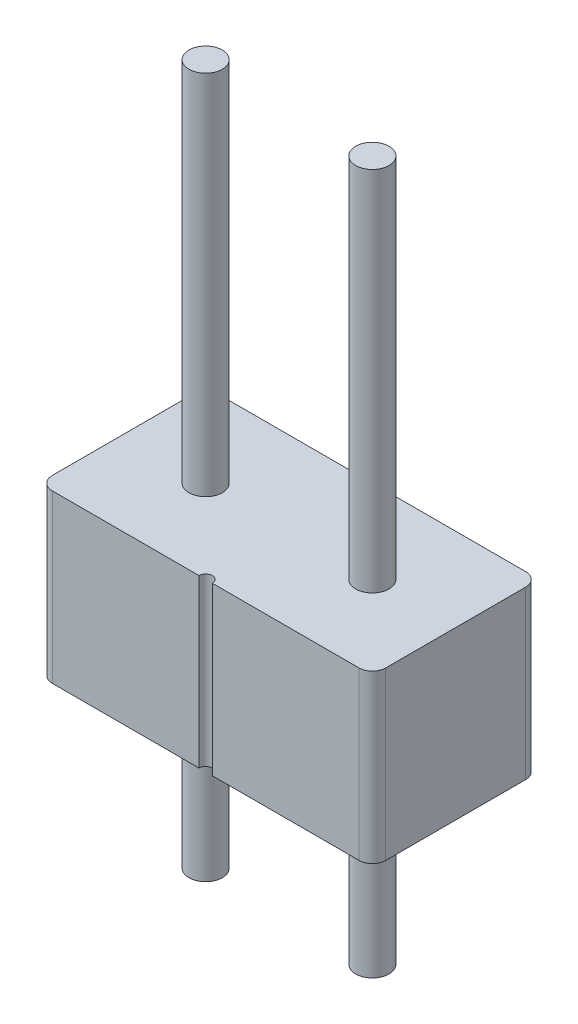
ISO-10303-21;
HEADER;
FILE_DESCRIPTION(('STEP AP214'),'2;1');
FILE_NAME('part.step','',(''),(''),'','','');
FILE_SCHEMA(('AUTOMOTIVE_DESIGN { 1 0 10303 214 1 1 1 1 }'));
ENDSEC;
DATA;
#1=APPLICATION_CONTEXT('core data for automotive mechanical design processes');
#2=APPLICATION_PROTOCOL_DEFINITION('international standard','automotive_design',2000,#1);
#3=PRODUCT_CONTEXT('',#1,'mechanical');
#4=PRODUCT('Part','Part','',(#3));
#5=PRODUCT_RELATED_PRODUCT_CATEGORY('part','',(#4));
#6=PRODUCT_DEFINITION_FORMATION('','',#4);
#7=PRODUCT_DEFINITION_CONTEXT('part definition',#1,'design');
#8=PRODUCT_DEFINITION('design','',#6,#7);
#9=PRODUCT_DEFINITION_SHAPE('','',#8);
#10=(LENGTH_UNIT() NAMED_UNIT(*) SI_UNIT(.MILLI.,.METRE.));
#11=(NAMED_UNIT(*) PLANE_ANGLE_UNIT() SI_UNIT($,.RADIAN.));
#12=(NAMED_UNIT(*) SI_UNIT($,.STERADIAN.) SOLID_ANGLE_UNIT());
#13=UNCERTAINTY_MEASURE_WITH_UNIT(LENGTH_MEASURE(1.E-05),#10,'distance_accuracy_value','');
#14=(GEOMETRIC_REPRESENTATION_CONTEXT(3) GLOBAL_UNCERTAINTY_ASSIGNED_CONTEXT((#13)) GLOBAL_UNIT_ASSIGNED_CONTEXT((#10,
#11,#12)) REPRESENTATION_CONTEXT('',''));
#15=CARTESIAN_POINT('',(0.,0.,0.));
#16=DIRECTION('',(0.,0.,1.));
#17=DIRECTION('',(1.,0.,0.));
#18=AXIS2_PLACEMENT_3D('',#15,#16,#17);
#19=CARTESIAN_POINT('',(0.,2.5,-1.25));
#20=DIRECTION('',(0.,1.,0.));
#21=DIRECTION('',(0.,0.,1.));
#22=AXIS2_PLACEMENT_3D('',#19,#20,#21);
#23=PLANE('',#22);
#24=CARTESIAN_POINT('',(-1.25,2.5,0.));
#25=DIRECTION('',(0.,1.,0.));
#26=DIRECTION('',(0.,0.,1.));
#27=AXIS2_PLACEMENT_3D('',#24,#25,#26);
#28=CIRCLE('',#27,0.25);
#29=CARTESIAN_POINT('',(-1.25,2.5,0.249999999999999));
#30=VERTEX_POINT('',#29);
#31=EDGE_CURVE('E157',#30,#30,#28,.T.);
#32=ORIENTED_EDGE('',*,*,#31,.F.);
#33=EDGE_LOOP('',(#32));
#34=FACE_BOUND('',#33,.T.);
#35=CARTESIAN_POINT('',(0.,2.5,-1.25));
#36=DIRECTION('',(0.,-1.,0.));
#37=DIRECTION('',(0.,0.,1.));
#38=AXIS2_PLACEMENT_3D('',#35,#36,#37);
#39=CIRCLE('',#38,0.1);
#40=CARTESIAN_POINT('',(0.0999999999999996,2.5,-1.25));
#41=VERTEX_POINT('',#40);
#42=CARTESIAN_POINT('',(-0.1,2.5,-1.25));
#43=VERTEX_POINT('',#42);
#44=EDGE_CURVE('E176',#41,#43,#39,.T.);
#45=ORIENTED_EDGE('',*,*,#44,.T.);
#46=DIRECTION('',(-1.,0.,0.));
#47=VECTOR('',#46,1.);
#48=CARTESIAN_POINT('',(-2.3,2.5,-1.25));
#49=LINE('',#48,#47);
#50=CARTESIAN_POINT('',(-2.3,2.5,-1.25));
#51=VERTEX_POINT('',#50);
#52=EDGE_CURVE('E104',#43,#51,#49,.T.);
#53=ORIENTED_EDGE('',*,*,#52,.T.);
#54=CARTESIAN_POINT('',(-2.3,2.5,-1.05));
#55=DIRECTION('',(0.,1.,0.));
#56=DIRECTION('',(0.,0.,1.));
#57=AXIS2_PLACEMENT_3D('',#54,#55,#56);
#58=CIRCLE('',#57,0.2);
#59=CARTESIAN_POINT('',(-2.5,2.5,-1.05));
#60=VERTEX_POINT('',#59);
#61=EDGE_CURVE('E203',#51,#60,#58,.T.);
#62=ORIENTED_EDGE('',*,*,#61,.T.);
#63=DIRECTION('',(0.,0.,1.));
#64=VECTOR('',#63,1.);
#65=CARTESIAN_POINT('',(-2.5,2.5,-1.05));
#66=LINE('',#65,#64);
#67=CARTESIAN_POINT('',(-2.5,2.5,1.05));
#68=VERTEX_POINT('',#67);
#69=EDGE_CURVE('E222',#60,#68,#66,.T.);
#70=ORIENTED_EDGE('',*,*,#69,.T.);
#71=CARTESIAN_POINT('',(-2.3,2.5,1.05));
#72=DIRECTION('',(0.,1.,0.));
#73=DIRECTION('',(0.,0.,1.));
#74=AXIS2_PLACEMENT_3D('',#71,#72,#73);
#75=CIRCLE('',#74,0.2);
#76=CARTESIAN_POINT('',(-2.3,2.5,1.25));
#77=VERTEX_POINT('',#76);
#78=EDGE_CURVE('E219',#68,#77,#75,.T.);
#79=ORIENTED_EDGE('',*,*,#78,.T.);
#80=DIRECTION('',(1.,0.,0.));
#81=VECTOR('',#80,1.);
#82=CARTESIAN_POINT('',(-2.3,2.5,1.25));
#83=LINE('',#82,#81);
#84=CARTESIAN_POINT('',(-0.0999999999999996,2.5,1.25));
#85=VERTEX_POINT('',#84);
#86=EDGE_CURVE('E221',#77,#85,#83,.T.);
#87=ORIENTED_EDGE('',*,*,#86,.T.);
#88=CARTESIAN_POINT('',(0.,2.5,1.25));
#89=DIRECTION('',(0.,-1.,0.));
#90=DIRECTION('',(0.,0.,1.));
#91=AXIS2_PLACEMENT_3D('',#88,#89,#90);
#92=CIRCLE('',#91,0.1);
#93=CARTESIAN_POINT('',(0.1,2.5,1.25));
#94=VERTEX_POINT('',#93);
#95=EDGE_CURVE('E224',#85,#94,#92,.T.);
#96=ORIENTED_EDGE('',*,*,#95,.T.);
#97=DIRECTION('',(1.,0.,0.));
#98=VECTOR('',#97,1.);
#99=CARTESIAN_POINT('',(0.1,2.5,1.25));
#100=LINE('',#99,#98);
#101=CARTESIAN_POINT('',(2.3,2.5,1.25));
#102=VERTEX_POINT('',#101);
#103=EDGE_CURVE('E230',#94,#102,#100,.T.);
#104=ORIENTED_EDGE('',*,*,#103,.T.);
#105=CARTESIAN_POINT('',(2.3,2.5,1.05));
#106=DIRECTION('',(0.,1.,0.));
#107=DIRECTION('',(0.,0.,1.));
#108=AXIS2_PLACEMENT_3D('',#105,#106,#107);
#109=CIRCLE('',#108,0.2);
#110=CARTESIAN_POINT('',(2.5,2.5,1.05));
#111=VERTEX_POINT('',#110);
#112=EDGE_CURVE('E135',#102,#111,#109,.T.);
#113=ORIENTED_EDGE('',*,*,#112,.T.);
#114=DIRECTION('',(0.,0.,-1.));
#115=VECTOR('',#114,1.);
#116=CARTESIAN_POINT('',(2.5,2.5,-1.05));
#117=LINE('',#116,#115);
#118=CARTESIAN_POINT('',(2.5,2.5,-1.05));
#119=VERTEX_POINT('',#118);
#120=EDGE_CURVE('E129',#111,#119,#117,.T.);
#121=ORIENTED_EDGE('',*,*,#120,.T.);
#122=CARTESIAN_POINT('',(2.3,2.5,-1.05));
#123=DIRECTION('',(0.,1.,0.));
#124=DIRECTION('',(0.,0.,-1.));
#125=AXIS2_PLACEMENT_3D('',#122,#123,#124);
#126=CIRCLE('',#125,0.2);
#127=CARTESIAN_POINT('',(2.3,2.5,-1.25));
#128=VERTEX_POINT('',#127);
#129=EDGE_CURVE('E133',#119,#128,#126,.T.);
#130=ORIENTED_EDGE('',*,*,#129,.T.);
#131=DIRECTION('',(-1.,0.,0.));
#132=VECTOR('',#131,1.);
#133=CARTESIAN_POINT('',(0.0999999999999996,2.5,-1.25));
#134=LINE('',#133,#132);
#135=EDGE_CURVE('E49',#128,#41,#134,.T.);
#136=ORIENTED_EDGE('',*,*,#135,.T.);
#137=EDGE_LOOP('',(#45,#53,#62,#70,#79,#87,#96,#104,#113,#121,#130,#136));
#138=FACE_BOUND('',#137,.T.);
#139=CARTESIAN_POINT('',(1.25,2.5,0.));
#140=DIRECTION('',(0.,1.,0.));
#141=DIRECTION('',(0.,0.,1.));
#142=AXIS2_PLACEMENT_3D('',#139,#140,#141);
#143=CIRCLE('',#142,0.25);
#144=CARTESIAN_POINT('',(1.25,2.5,0.249999999999999));
#145=VERTEX_POINT('',#144);
#146=EDGE_CURVE('E308',#145,#145,#143,.T.);
#147=ORIENTED_EDGE('',*,*,#146,.F.);
#148=EDGE_LOOP('',(#147));
#149=FACE_BOUND('',#148,.T.);
#150=ADVANCED_FACE('F32',(#34,#138,#149),#23,.T.);
#151=CARTESIAN_POINT('',(0.,0.,-1.25));
#152=DIRECTION('',(0.,1.,0.));
#153=DIRECTION('',(0.,0.,1.));
#154=AXIS2_PLACEMENT_3D('',#151,#152,#153);
#155=PLANE('',#154);
#156=CARTESIAN_POINT('',(0.,0.,-1.25));
#157=DIRECTION('',(0.,-1.,0.));
#158=DIRECTION('',(0.,0.,1.));
#159=AXIS2_PLACEMENT_3D('',#156,#157,#158);
#160=CIRCLE('',#159,0.1);
#161=CARTESIAN_POINT('',(0.0999999999999996,0.,-1.25));
#162=VERTEX_POINT('',#161);
#163=CARTESIAN_POINT('',(-0.1,0.,-1.25));
#164=VERTEX_POINT('',#163);
#165=EDGE_CURVE('E153',#162,#164,#160,.T.);
#166=ORIENTED_EDGE('',*,*,#165,.F.);
#167=DIRECTION('',(-1.,0.,0.));
#168=VECTOR('',#167,1.);
#169=CARTESIAN_POINT('',(0.0999999999999996,0.,-1.25));
#170=LINE('',#169,#168);
#171=CARTESIAN_POINT('',(2.3,0.,-1.25));
#172=VERTEX_POINT('',#171);
#173=EDGE_CURVE('E96',#172,#162,#170,.T.);
#174=ORIENTED_EDGE('',*,*,#173,.F.);
#175=CARTESIAN_POINT('',(2.3,0.,-1.05));
#176=DIRECTION('',(0.,1.,0.));
#177=DIRECTION('',(0.,0.,-1.));
#178=AXIS2_PLACEMENT_3D('',#175,#176,#177);
#179=CIRCLE('',#178,0.2);
#180=CARTESIAN_POINT('',(2.5,0.,-1.05));
#181=VERTEX_POINT('',#180);
#182=EDGE_CURVE('E90',#181,#172,#179,.T.);
#183=ORIENTED_EDGE('',*,*,#182,.F.);
#184=DIRECTION('',(0.,0.,-1.));
#185=VECTOR('',#184,1.);
#186=CARTESIAN_POINT('',(2.5,0.,-1.05));
#187=LINE('',#186,#185);
#188=CARTESIAN_POINT('',(2.5,0.,1.05));
#189=VERTEX_POINT('',#188);
#190=EDGE_CURVE('E143',#189,#181,#187,.T.);
#191=ORIENTED_EDGE('',*,*,#190,.F.);
#192=CARTESIAN_POINT('',(2.3,0.,1.05));
#193=DIRECTION('',(0.,1.,0.));
#194=DIRECTION('',(0.,0.,1.));
#195=AXIS2_PLACEMENT_3D('',#192,#193,#194);
#196=CIRCLE('',#195,0.2);
#197=CARTESIAN_POINT('',(2.3,0.,1.25));
#198=VERTEX_POINT('',#197);
#199=EDGE_CURVE('E171',#198,#189,#196,.T.);
#200=ORIENTED_EDGE('',*,*,#199,.F.);
#201=DIRECTION('',(1.,0.,0.));
#202=VECTOR('',#201,1.);
#203=CARTESIAN_POINT('',(0.1,0.,1.25));
#204=LINE('',#203,#202);
#205=CARTESIAN_POINT('',(0.1,0.,1.25));
#206=VERTEX_POINT('',#205);
#207=EDGE_CURVE('E169',#206,#198,#204,.T.);
#208=ORIENTED_EDGE('',*,*,#207,.F.);
#209=CARTESIAN_POINT('',(0.,0.,1.25));
#210=DIRECTION('',(0.,-1.,0.));
#211=DIRECTION('',(0.,0.,1.));
#212=AXIS2_PLACEMENT_3D('',#209,#210,#211);
#213=CIRCLE('',#212,0.1);
#214=CARTESIAN_POINT('',(-0.0999999999999996,0.,1.25));
#215=VERTEX_POINT('',#214);
#216=EDGE_CURVE('E167',#215,#206,#213,.T.);
#217=ORIENTED_EDGE('',*,*,#216,.F.);
#218=DIRECTION('',(1.,0.,0.));
#219=VECTOR('',#218,1.);
#220=CARTESIAN_POINT('',(-2.3,0.,1.25));
#221=LINE('',#220,#219);
#222=CARTESIAN_POINT('',(-2.3,0.,1.25));
#223=VERTEX_POINT('',#222);
#224=EDGE_CURVE('E165',#223,#215,#221,.T.);
#225=ORIENTED_EDGE('',*,*,#224,.F.);
#226=CARTESIAN_POINT('',(-2.3,0.,1.05));
#227=DIRECTION('',(0.,1.,0.));
#228=DIRECTION('',(0.,0.,1.));
#229=AXIS2_PLACEMENT_3D('',#226,#227,#228);
#230=CIRCLE('',#229,0.2);
#231=CARTESIAN_POINT('',(-2.5,0.,1.05));
#232=VERTEX_POINT('',#231);
#233=EDGE_CURVE('E163',#232,#223,#230,.T.);
#234=ORIENTED_EDGE('',*,*,#233,.F.);
#235=DIRECTION('',(0.,0.,1.));
#236=VECTOR('',#235,1.);
#237=CARTESIAN_POINT('',(-2.5,0.,-1.05));
#238=LINE('',#237,#236);
#239=CARTESIAN_POINT('',(-2.5,0.,-1.05));
#240=VERTEX_POINT('',#239);
#241=EDGE_CURVE('E161',#240,#232,#238,.T.);
#242=ORIENTED_EDGE('',*,*,#241,.F.);
#243=CARTESIAN_POINT('',(-2.3,0.,-1.05));
#244=DIRECTION('',(0.,1.,0.));
#245=DIRECTION('',(0.,0.,1.));
#246=AXIS2_PLACEMENT_3D('',#243,#244,#245);
#247=CIRCLE('',#246,0.2);
#248=CARTESIAN_POINT('',(-2.3,0.,-1.25));
#249=VERTEX_POINT('',#248);
#250=EDGE_CURVE('E159',#249,#240,#247,.T.);
#251=ORIENTED_EDGE('',*,*,#250,.F.);
#252=DIRECTION('',(-1.,0.,0.));
#253=VECTOR('',#252,1.);
#254=CARTESIAN_POINT('',(-2.3,0.,-1.25));
#255=LINE('',#254,#253);
#256=EDGE_CURVE('E156',#164,#249,#255,.T.);
#257=ORIENTED_EDGE('',*,*,#256,.F.);
#258=EDGE_LOOP('',(#166,#174,#183,#191,#200,#208,#217,#225,#234,#242,#251,#257));
#259=FACE_BOUND('',#258,.T.);
#260=CARTESIAN_POINT('',(-1.25,0.,0.));
#261=DIRECTION('',(0.,1.,0.));
#262=DIRECTION('',(0.,0.,1.));
#263=AXIS2_PLACEMENT_3D('',#260,#261,#262);
#264=CIRCLE('',#263,0.25);
#265=CARTESIAN_POINT('',(-1.25,0.,0.249999999999999));
#266=VERTEX_POINT('',#265);
#267=EDGE_CURVE('E305',#266,#266,#264,.T.);
#268=ORIENTED_EDGE('',*,*,#267,.T.);
#269=EDGE_LOOP('',(#268));
#270=FACE_BOUND('',#269,.T.);
#271=CARTESIAN_POINT('',(1.25,0.,0.));
#272=DIRECTION('',(0.,1.,0.));
#273=DIRECTION('',(0.,0.,1.));
#274=AXIS2_PLACEMENT_3D('',#271,#272,#273);
#275=CIRCLE('',#274,0.25);
#276=CARTESIAN_POINT('',(1.25,0.,0.249999999999999));
#277=VERTEX_POINT('',#276);
#278=EDGE_CURVE('E294',#277,#277,#275,.T.);
#279=ORIENTED_EDGE('',*,*,#278,.T.);
#280=EDGE_LOOP('',(#279));
#281=FACE_BOUND('',#280,.T.);
#282=ADVANCED_FACE('F207',(#259,#270,#281),#155,.F.);
#283=CARTESIAN_POINT('',(0.,2.5,-1.25));
#284=DIRECTION('',(0.,-1.,0.));
#285=DIRECTION('',(0.,0.,-1.));
#286=AXIS2_PLACEMENT_3D('',#283,#284,#285);
#287=CYLINDRICAL_SURFACE('',#286,0.1);
#288=ORIENTED_EDGE('',*,*,#165,.T.);
#289=DIRECTION('',(0.,-1.,0.));
#290=VECTOR('',#289,1.);
#291=CARTESIAN_POINT('',(-0.1,2.5,-1.25));
#292=LINE('',#291,#290);
#293=EDGE_CURVE('E11',#43,#164,#292,.T.);
#294=ORIENTED_EDGE('',*,*,#293,.F.);
#295=ORIENTED_EDGE('',*,*,#44,.F.);
#296=DIRECTION('',(0.,-1.,0.));
#297=VECTOR('',#296,1.);
#298=CARTESIAN_POINT('',(0.0999999999999996,2.5,-1.25));
#299=LINE('',#298,#297);
#300=EDGE_CURVE('E149',#41,#162,#299,.T.);
#301=ORIENTED_EDGE('',*,*,#300,.T.);
#302=EDGE_LOOP('',(#288,#294,#295,#301));
#303=FACE_BOUND('',#302,.T.);
#304=ADVANCED_FACE('F34',(#303),#287,.F.);
#305=CARTESIAN_POINT('',(-2.3,2.5,-1.25));
#306=DIRECTION('',(0.,0.,1.));
#307=DIRECTION('',(1.,0.,0.));
#308=AXIS2_PLACEMENT_3D('',#305,#306,#307);
#309=PLANE('',#308);
#310=ORIENTED_EDGE('',*,*,#256,.T.);
#311=DIRECTION('',(0.,-1.,0.));
#312=VECTOR('',#311,1.);
#313=CARTESIAN_POINT('',(-2.3,2.5,-1.25));
#314=LINE('',#313,#312);
#315=EDGE_CURVE('E41',#51,#249,#314,.T.);
#316=ORIENTED_EDGE('',*,*,#315,.F.);
#317=ORIENTED_EDGE('',*,*,#52,.F.);
#318=ORIENTED_EDGE('',*,*,#293,.T.);
#319=EDGE_LOOP('',(#310,#316,#317,#318));
#320=FACE_BOUND('',#319,.T.);
#321=ADVANCED_FACE('F439',(#320),#309,.F.);
#322=CARTESIAN_POINT('',(-2.3,2.5,-1.05));
#323=DIRECTION('',(0.,-1.,0.));
#324=DIRECTION('',(0.,0.,-1.));
#325=AXIS2_PLACEMENT_3D('',#322,#323,#324);
#326=CYLINDRICAL_SURFACE('',#325,0.2);
#327=ORIENTED_EDGE('',*,*,#250,.T.);
#328=DIRECTION('',(0.,-1.,0.));
#329=VECTOR('',#328,1.);
#330=CARTESIAN_POINT('',(-2.5,2.5,-1.05));
#331=LINE('',#330,#329);
#332=EDGE_CURVE('E195',#60,#240,#331,.T.);
#333=ORIENTED_EDGE('',*,*,#332,.F.);
#334=ORIENTED_EDGE('',*,*,#61,.F.);
#335=ORIENTED_EDGE('',*,*,#315,.T.);
#336=EDGE_LOOP('',(#327,#333,#334,#335));
#337=FACE_BOUND('',#336,.T.);
#338=ADVANCED_FACE('F201',(#337),#326,.T.);
#339=CARTESIAN_POINT('',(-2.5,2.5,-1.05));
#340=DIRECTION('',(1.,0.,0.));
#341=DIRECTION('',(0.,0.,-1.));
#342=AXIS2_PLACEMENT_3D('',#339,#340,#341);
#343=PLANE('',#342);
#344=ORIENTED_EDGE('',*,*,#241,.T.);
#345=DIRECTION('',(0.,-1.,0.));
#346=VECTOR('',#345,1.);
#347=CARTESIAN_POINT('',(-2.5,2.5,1.05));
#348=LINE('',#347,#346);
#349=EDGE_CURVE('E192',#68,#232,#348,.T.);
#350=ORIENTED_EDGE('',*,*,#349,.F.);
#351=ORIENTED_EDGE('',*,*,#69,.F.);
#352=ORIENTED_EDGE('',*,*,#332,.T.);
#353=EDGE_LOOP('',(#344,#350,#351,#352));
#354=FACE_BOUND('',#353,.T.);
#355=ADVANCED_FACE('F213',(#354),#343,.F.);
#356=CARTESIAN_POINT('',(-2.3,2.5,1.05));
#357=DIRECTION('',(0.,-1.,0.));
#358=DIRECTION('',(0.,0.,-1.));
#359=AXIS2_PLACEMENT_3D('',#356,#357,#358);
#360=CYLINDRICAL_SURFACE('',#359,0.2);
#361=ORIENTED_EDGE('',*,*,#233,.T.);
#362=DIRECTION('',(0.,-1.,0.));
#363=VECTOR('',#362,1.);
#364=CARTESIAN_POINT('',(-2.3,2.5,1.25));
#365=LINE('',#364,#363);
#366=EDGE_CURVE('E189',#77,#223,#365,.T.);
#367=ORIENTED_EDGE('',*,*,#366,.F.);
#368=ORIENTED_EDGE('',*,*,#78,.F.);
#369=ORIENTED_EDGE('',*,*,#349,.T.);
#370=EDGE_LOOP('',(#361,#367,#368,#369));
#371=FACE_BOUND('',#370,.T.);
#372=ADVANCED_FACE('F217',(#371),#360,.T.);
#373=CARTESIAN_POINT('',(-2.3,2.5,1.25));
#374=DIRECTION('',(0.,0.,-1.));
#375=DIRECTION('',(-1.,0.,0.));
#376=AXIS2_PLACEMENT_3D('',#373,#374,#375);
#377=PLANE('',#376);
#378=ORIENTED_EDGE('',*,*,#224,.T.);
#379=DIRECTION('',(0.,-1.,0.));
#380=VECTOR('',#379,1.);
#381=CARTESIAN_POINT('',(-0.0999999999999996,2.5,1.25));
#382=LINE('',#381,#380);
#383=EDGE_CURVE('E186',#85,#215,#382,.T.);
#384=ORIENTED_EDGE('',*,*,#383,.F.);
#385=ORIENTED_EDGE('',*,*,#86,.F.);
#386=ORIENTED_EDGE('',*,*,#366,.T.);
#387=EDGE_LOOP('',(#378,#384,#385,#386));
#388=FACE_BOUND('',#387,.T.);
#389=ADVANCED_FACE('F408',(#388),#377,.F.);
#390=CARTESIAN_POINT('',(0.,2.5,1.25));
#391=DIRECTION('',(0.,-1.,0.));
#392=DIRECTION('',(0.,0.,-1.));
#393=AXIS2_PLACEMENT_3D('',#390,#391,#392);
#394=CYLINDRICAL_SURFACE('',#393,0.1);
#395=ORIENTED_EDGE('',*,*,#216,.T.);
#396=DIRECTION('',(0.,-1.,0.));
#397=VECTOR('',#396,1.);
#398=CARTESIAN_POINT('',(0.1,2.5,1.25));
#399=LINE('',#398,#397);
#400=EDGE_CURVE('E183',#94,#206,#399,.T.);
#401=ORIENTED_EDGE('',*,*,#400,.F.);
#402=ORIENTED_EDGE('',*,*,#95,.F.);
#403=ORIENTED_EDGE('',*,*,#383,.T.);
#404=EDGE_LOOP('',(#395,#401,#402,#403));
#405=FACE_BOUND('',#404,.T.);
#406=ADVANCED_FACE('F400',(#405),#394,.F.);
#407=CARTESIAN_POINT('',(0.1,2.5,1.25));
#408=DIRECTION('',(0.,0.,-1.));
#409=DIRECTION('',(-1.,0.,0.));
#410=AXIS2_PLACEMENT_3D('',#407,#408,#409);
#411=PLANE('',#410);
#412=ORIENTED_EDGE('',*,*,#207,.T.);
#413=DIRECTION('',(0.,-1.,0.));
#414=VECTOR('',#413,1.);
#415=CARTESIAN_POINT('',(2.3,2.5,1.25));
#416=LINE('',#415,#414);
#417=EDGE_CURVE('E180',#102,#198,#416,.T.);
#418=ORIENTED_EDGE('',*,*,#417,.F.);
#419=ORIENTED_EDGE('',*,*,#103,.F.);
#420=ORIENTED_EDGE('',*,*,#400,.T.);
#421=EDGE_LOOP('',(#412,#418,#419,#420));
#422=FACE_BOUND('',#421,.T.);
#423=ADVANCED_FACE('F236',(#422),#411,.F.);
#424=CARTESIAN_POINT('',(2.3,2.5,1.05));
#425=DIRECTION('',(0.,-1.,0.));
#426=DIRECTION('',(0.,0.,-1.));
#427=AXIS2_PLACEMENT_3D('',#424,#425,#426);
#428=CYLINDRICAL_SURFACE('',#427,0.2);
#429=ORIENTED_EDGE('',*,*,#199,.T.);
#430=DIRECTION('',(0.,-1.,0.));
#431=VECTOR('',#430,1.);
#432=CARTESIAN_POINT('',(2.5,2.5,1.05));
#433=LINE('',#432,#431);
#434=EDGE_CURVE('E144',#111,#189,#433,.T.);
#435=ORIENTED_EDGE('',*,*,#434,.F.);
#436=ORIENTED_EDGE('',*,*,#112,.F.);
#437=ORIENTED_EDGE('',*,*,#417,.T.);
#438=EDGE_LOOP('',(#429,#435,#436,#437));
#439=FACE_BOUND('',#438,.T.);
#440=ADVANCED_FACE('F240',(#439),#428,.T.);
#441=CARTESIAN_POINT('',(2.5,2.5,-1.05));
#442=DIRECTION('',(-1.,0.,0.));
#443=DIRECTION('',(0.,0.,1.));
#444=AXIS2_PLACEMENT_3D('',#441,#442,#443);
#445=PLANE('',#444);
#446=ORIENTED_EDGE('',*,*,#190,.T.);
#447=DIRECTION('',(0.,-1.,0.));
#448=VECTOR('',#447,1.);
#449=CARTESIAN_POINT('',(2.5,2.5,-1.05));
#450=LINE('',#449,#448);
#451=EDGE_CURVE('E140',#119,#181,#450,.T.);
#452=ORIENTED_EDGE('',*,*,#451,.F.);
#453=ORIENTED_EDGE('',*,*,#120,.F.);
#454=ORIENTED_EDGE('',*,*,#434,.T.);
#455=EDGE_LOOP('',(#446,#452,#453,#454));
#456=FACE_BOUND('',#455,.T.);
#457=ADVANCED_FACE('F141',(#456),#445,.F.);
#458=CARTESIAN_POINT('',(2.3,2.5,-1.05));
#459=DIRECTION('',(0.,-1.,0.));
#460=DIRECTION('',(0.,0.,-1.));
#461=AXIS2_PLACEMENT_3D('',#458,#459,#460);
#462=CYLINDRICAL_SURFACE('',#461,0.2);
#463=ORIENTED_EDGE('',*,*,#182,.T.);
#464=DIRECTION('',(0.,-1.,0.));
#465=VECTOR('',#464,1.);
#466=CARTESIAN_POINT('',(2.3,2.5,-1.25));
#467=LINE('',#466,#465);
#468=EDGE_CURVE('E145',#128,#172,#467,.T.);
#469=ORIENTED_EDGE('',*,*,#468,.F.);
#470=ORIENTED_EDGE('',*,*,#129,.F.);
#471=ORIENTED_EDGE('',*,*,#451,.T.);
#472=EDGE_LOOP('',(#463,#469,#470,#471));
#473=FACE_BOUND('',#472,.T.);
#474=ADVANCED_FACE('F147',(#473),#462,.T.);
#475=CARTESIAN_POINT('',(0.0999999999999996,2.5,-1.25));
#476=DIRECTION('',(0.,0.,1.));
#477=DIRECTION('',(1.,0.,0.));
#478=AXIS2_PLACEMENT_3D('',#475,#476,#477);
#479=PLANE('',#478);
#480=ORIENTED_EDGE('',*,*,#173,.T.);
#481=ORIENTED_EDGE('',*,*,#300,.F.);
#482=ORIENTED_EDGE('',*,*,#135,.F.);
#483=ORIENTED_EDGE('',*,*,#468,.T.);
#484=EDGE_LOOP('',(#480,#481,#482,#483));
#485=FACE_BOUND('',#484,.T.);
#486=ADVANCED_FACE('F244',(#485),#479,.F.);
#487=CARTESIAN_POINT('',(-1.25,-2.5,0.));
#488=DIRECTION('',(0.,1.,0.));
#489=DIRECTION('',(0.,0.,1.));
#490=AXIS2_PLACEMENT_3D('',#487,#488,#489);
#491=PLANE('',#490);
#492=CARTESIAN_POINT('',(-1.25,-2.5,0.));
#493=DIRECTION('',(0.,1.,0.));
#494=DIRECTION('',(0.,0.,1.));
#495=AXIS2_PLACEMENT_3D('',#492,#493,#494);
#496=CIRCLE('',#495,0.25);
#497=CARTESIAN_POINT('',(-1.25,-2.5,0.249999999999999));
#498=VERTEX_POINT('',#497);
#499=EDGE_CURVE('E302',#498,#498,#496,.T.);
#500=ORIENTED_EDGE('',*,*,#499,.F.);
#501=EDGE_LOOP('',(#500));
#502=FACE_BOUND('',#501,.T.);
#503=ADVANCED_FACE('F246',(#502),#491,.F.);
#504=CARTESIAN_POINT('',(-1.25,-2.5,0.));
#505=DIRECTION('',(0.,1.,0.));
#506=DIRECTION('',(0.,0.,1.));
#507=AXIS2_PLACEMENT_3D('',#504,#505,#506);
#508=CYLINDRICAL_SURFACE('',#507,0.25);
#509=ORIENTED_EDGE('',*,*,#499,.T.);
#510=EDGE_LOOP('',(#509));
#511=FACE_BOUND('',#510,.T.);
#512=ORIENTED_EDGE('',*,*,#267,.F.);
#513=EDGE_LOOP('',(#512));
#514=FACE_BOUND('',#513,.T.);
#515=ADVANCED_FACE('F252',(#511,#514),#508,.T.);
#516=ORIENTED_EDGE('',*,*,#31,.T.);
#517=EDGE_LOOP('',(#516));
#518=FACE_BOUND('',#517,.T.);
#519=CARTESIAN_POINT('',(-1.25,8.,0.));
#520=DIRECTION('',(0.,1.,0.));
#521=DIRECTION('',(0.,0.,1.));
#522=AXIS2_PLACEMENT_3D('',#519,#520,#521);
#523=CIRCLE('',#522,0.25);
#524=CARTESIAN_POINT('',(-1.25,8.,0.249999999999999));
#525=VERTEX_POINT('',#524);
#526=EDGE_CURVE('E299',#525,#525,#523,.T.);
#527=ORIENTED_EDGE('',*,*,#526,.F.);
#528=EDGE_LOOP('',(#527));
#529=FACE_BOUND('',#528,.T.);
#530=ADVANCED_FACE('F265',(#518,#529),#508,.T.);
#531=CARTESIAN_POINT('',(-1.25,8.,0.));
#532=DIRECTION('',(0.,1.,0.));
#533=DIRECTION('',(0.,0.,1.));
#534=AXIS2_PLACEMENT_3D('',#531,#532,#533);
#535=PLANE('',#534);
#536=ORIENTED_EDGE('',*,*,#526,.T.);
#537=EDGE_LOOP('',(#536));
#538=FACE_BOUND('',#537,.T.);
#539=ADVANCED_FACE('F267',(#538),#535,.T.);
#540=CARTESIAN_POINT('',(1.25,-2.5,0.));
#541=DIRECTION('',(0.,1.,0.));
#542=DIRECTION('',(0.,0.,1.));
#543=AXIS2_PLACEMENT_3D('',#540,#541,#542);
#544=PLANE('',#543);
#545=CARTESIAN_POINT('',(1.25,-2.5,0.));
#546=DIRECTION('',(0.,1.,0.));
#547=DIRECTION('',(0.,0.,1.));
#548=AXIS2_PLACEMENT_3D('',#545,#546,#547);
#549=CIRCLE('',#548,0.25);
#550=CARTESIAN_POINT('',(1.25,-2.5,0.249999999999999));
#551=VERTEX_POINT('',#550);
#552=EDGE_CURVE('E291',#551,#551,#549,.T.);
#553=ORIENTED_EDGE('',*,*,#552,.F.);
#554=EDGE_LOOP('',(#553));
#555=FACE_BOUND('',#554,.T.);
#556=ADVANCED_FACE('F272',(#555),#544,.F.);
#557=CARTESIAN_POINT('',(1.25,-2.5,0.));
#558=DIRECTION('',(0.,1.,0.));
#559=DIRECTION('',(0.,0.,1.));
#560=AXIS2_PLACEMENT_3D('',#557,#558,#559);
#561=CYLINDRICAL_SURFACE('',#560,0.25);
#562=ORIENTED_EDGE('',*,*,#552,.T.);
#563=EDGE_LOOP('',(#562));
#564=FACE_BOUND('',#563,.T.);
#565=ORIENTED_EDGE('',*,*,#278,.F.);
#566=EDGE_LOOP('',(#565));
#567=FACE_BOUND('',#566,.T.);
#568=ADVANCED_FACE('F278',(#564,#567),#561,.T.);
#569=ORIENTED_EDGE('',*,*,#146,.T.);
#570=EDGE_LOOP('',(#569));
#571=FACE_BOUND('',#570,.T.);
#572=CARTESIAN_POINT('',(1.25,8.,0.));
#573=DIRECTION('',(0.,1.,0.));
#574=DIRECTION('',(0.,0.,1.));
#575=AXIS2_PLACEMENT_3D('',#572,#573,#574);
#576=CIRCLE('',#575,0.25);
#577=CARTESIAN_POINT('',(1.25,8.,0.249999999999999));
#578=VERTEX_POINT('',#577);
#579=EDGE_CURVE('E289',#578,#578,#576,.T.);
#580=ORIENTED_EDGE('',*,*,#579,.F.);
#581=EDGE_LOOP('',(#580));
#582=FACE_BOUND('',#581,.T.);
#583=ADVANCED_FACE('F274',(#571,#582),#561,.T.);
#584=CARTESIAN_POINT('',(1.25,8.,0.));
#585=DIRECTION('',(0.,1.,0.));
#586=DIRECTION('',(0.,0.,1.));
#587=AXIS2_PLACEMENT_3D('',#584,#585,#586);
#588=PLANE('',#587);
#589=ORIENTED_EDGE('',*,*,#579,.T.);
#590=EDGE_LOOP('',(#589));
#591=FACE_BOUND('',#590,.T.);
#592=ADVANCED_FACE('F277',(#591),#588,.T.);
#593=CLOSED_SHELL('',(#150,#282,#304,#321,#338,#355,#372,#389,#406,#423,#440,#457,#474,#486,
#503,#515,#530,#539,#556,#568,#583,#592));
#594=MANIFOLD_SOLID_BREP('B2',#593);
#595=ADVANCED_BREP_SHAPE_REPRESENTATION('',(#18,#594),#14);
#596=SHAPE_DEFINITION_REPRESENTATION(#9,#595);
ENDSEC;
END-ISO-10303-21;
